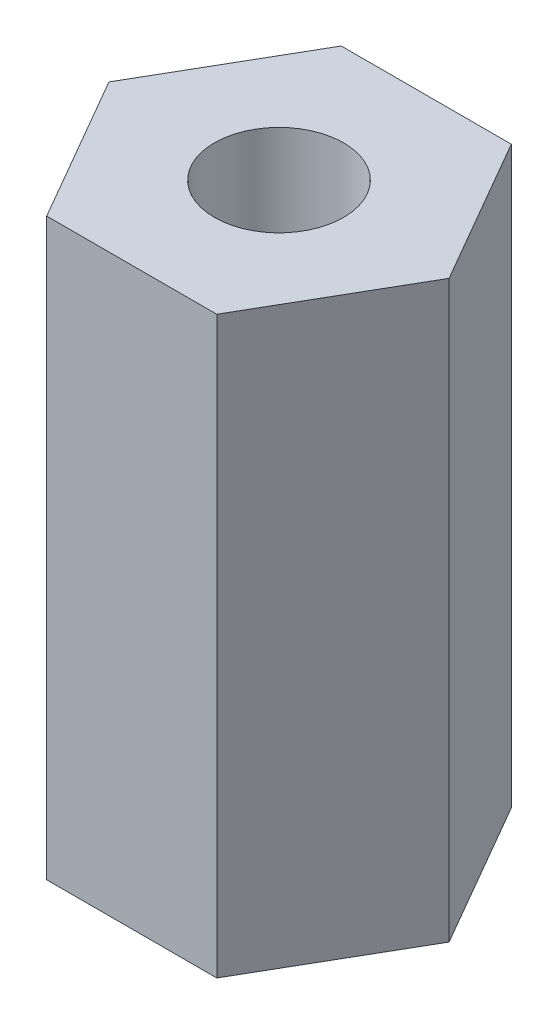
ISO-10303-21;
HEADER;
FILE_DESCRIPTION(('STEP AP214'),'2;1');
FILE_NAME('part.step','',(''),(''),'','','');
FILE_SCHEMA(('AUTOMOTIVE_DESIGN { 1 0 10303 214 1 1 1 1 }'));
ENDSEC;
DATA;
#1=APPLICATION_CONTEXT('core data for automotive mechanical design processes');
#2=APPLICATION_PROTOCOL_DEFINITION('international standard','automotive_design',2000,#1);
#3=PRODUCT_CONTEXT('',#1,'mechanical');
#4=PRODUCT('Part','Part','',(#3));
#5=PRODUCT_RELATED_PRODUCT_CATEGORY('part','',(#4));
#6=PRODUCT_DEFINITION_FORMATION('','',#4);
#7=PRODUCT_DEFINITION_CONTEXT('part definition',#1,'design');
#8=PRODUCT_DEFINITION('design','',#6,#7);
#9=PRODUCT_DEFINITION_SHAPE('','',#8);
#10=(LENGTH_UNIT() NAMED_UNIT(*) SI_UNIT(.MILLI.,.METRE.));
#11=(NAMED_UNIT(*) PLANE_ANGLE_UNIT() SI_UNIT($,.RADIAN.));
#12=(NAMED_UNIT(*) SI_UNIT($,.STERADIAN.) SOLID_ANGLE_UNIT());
#13=UNCERTAINTY_MEASURE_WITH_UNIT(LENGTH_MEASURE(1.E-05),#10,'distance_accuracy_value','');
#14=(GEOMETRIC_REPRESENTATION_CONTEXT(3) GLOBAL_UNCERTAINTY_ASSIGNED_CONTEXT((#13)) GLOBAL_UNIT_ASSIGNED_CONTEXT((#10,
#11,#12)) REPRESENTATION_CONTEXT('',''));
#15=CARTESIAN_POINT('',(0.,0.,0.));
#16=DIRECTION('',(0.,0.,1.));
#17=DIRECTION('',(1.,0.,0.));
#18=AXIS2_PLACEMENT_3D('',#15,#16,#17);
#19=CARTESIAN_POINT('',(2.5,16.9,4.3301270189222));
#20=DIRECTION('',(-0.866025403784439,0.,-0.5));
#21=DIRECTION('',(-0.5,0.,0.866025403784439));
#22=AXIS2_PLACEMENT_3D('',#19,#20,#21);
#23=PLANE('',#22);
#24=DIRECTION('',(0.5,0.,-0.866025403784439));
#25=VECTOR('',#24,1.);
#26=CARTESIAN_POINT('',(2.5,0.,4.3301270189222));
#27=LINE('',#26,#25);
#28=CARTESIAN_POINT('',(2.5,0.,4.3301270189222));
#29=VERTEX_POINT('',#28);
#30=CARTESIAN_POINT('',(5.,0.,0.));
#31=VERTEX_POINT('',#30);
#32=EDGE_CURVE('E122',#29,#31,#27,.T.);
#33=ORIENTED_EDGE('',*,*,#32,.T.);
#34=DIRECTION('',(0.,-1.,0.));
#35=VECTOR('',#34,1.);
#36=CARTESIAN_POINT('',(5.,16.9,0.));
#37=LINE('',#36,#35);
#38=CARTESIAN_POINT('',(5.,16.9,0.));
#39=VERTEX_POINT('',#38);
#40=EDGE_CURVE('E11',#39,#31,#37,.T.);
#41=ORIENTED_EDGE('',*,*,#40,.F.);
#42=DIRECTION('',(0.5,0.,-0.866025403784439));
#43=VECTOR('',#42,1.);
#44=CARTESIAN_POINT('',(2.5,16.9,4.3301270189222));
#45=LINE('',#44,#43);
#46=CARTESIAN_POINT('',(2.5,16.9,4.3301270189222));
#47=VERTEX_POINT('',#46);
#48=EDGE_CURVE('E133',#47,#39,#45,.T.);
#49=ORIENTED_EDGE('',*,*,#48,.F.);
#50=DIRECTION('',(0.,-1.,0.));
#51=VECTOR('',#50,1.);
#52=CARTESIAN_POINT('',(2.5,16.9,4.3301270189222));
#53=LINE('',#52,#51);
#54=EDGE_CURVE('E118',#47,#29,#53,.T.);
#55=ORIENTED_EDGE('',*,*,#54,.T.);
#56=EDGE_LOOP('',(#33,#41,#49,#55));
#57=FACE_BOUND('',#56,.T.);
#58=ADVANCED_FACE('F38',(#57),#23,.F.);
#59=CARTESIAN_POINT('',(5.,16.9,0.));
#60=DIRECTION('',(-0.866025403784439,0.,0.5));
#61=DIRECTION('',(0.5,0.,0.866025403784439));
#62=AXIS2_PLACEMENT_3D('',#59,#60,#61);
#63=PLANE('',#62);
#64=DIRECTION('',(-0.5,0.,-0.866025403784439));
#65=VECTOR('',#64,1.);
#66=CARTESIAN_POINT('',(5.,0.,0.));
#67=LINE('',#66,#65);
#68=CARTESIAN_POINT('',(2.5,0.,-4.3301270189222));
#69=VERTEX_POINT('',#68);
#70=EDGE_CURVE('E125',#31,#69,#67,.T.);
#71=ORIENTED_EDGE('',*,*,#70,.T.);
#72=DIRECTION('',(0.,-1.,0.));
#73=VECTOR('',#72,1.);
#74=CARTESIAN_POINT('',(2.5,16.9,-4.3301270189222));
#75=LINE('',#74,#73);
#76=CARTESIAN_POINT('',(2.5,16.9,-4.3301270189222));
#77=VERTEX_POINT('',#76);
#78=EDGE_CURVE('E46',#77,#69,#75,.T.);
#79=ORIENTED_EDGE('',*,*,#78,.F.);
#80=DIRECTION('',(-0.5,0.,-0.866025403784439));
#81=VECTOR('',#80,1.);
#82=CARTESIAN_POINT('',(5.,16.9,0.));
#83=LINE('',#82,#81);
#84=EDGE_CURVE('E91',#39,#77,#83,.T.);
#85=ORIENTED_EDGE('',*,*,#84,.F.);
#86=ORIENTED_EDGE('',*,*,#40,.T.);
#87=EDGE_LOOP('',(#71,#79,#85,#86));
#88=FACE_BOUND('',#87,.T.);
#89=ADVANCED_FACE('F158',(#88),#63,.F.);
#90=CARTESIAN_POINT('',(2.5,16.9,-4.3301270189222));
#91=DIRECTION('',(0.,0.,1.));
#92=DIRECTION('',(1.,0.,0.));
#93=AXIS2_PLACEMENT_3D('',#90,#91,#92);
#94=PLANE('',#93);
#95=DIRECTION('',(-1.,0.,0.));
#96=VECTOR('',#95,1.);
#97=CARTESIAN_POINT('',(2.5,0.,-4.3301270189222));
#98=LINE('',#97,#96);
#99=CARTESIAN_POINT('',(-2.5,0.,-4.3301270189222));
#100=VERTEX_POINT('',#99);
#101=EDGE_CURVE('E128',#69,#100,#98,.T.);
#102=ORIENTED_EDGE('',*,*,#101,.T.);
#103=DIRECTION('',(0.,-1.,0.));
#104=VECTOR('',#103,1.);
#105=CARTESIAN_POINT('',(-2.5,16.9,-4.3301270189222));
#106=LINE('',#105,#104);
#107=CARTESIAN_POINT('',(-2.5,16.9,-4.3301270189222));
#108=VERTEX_POINT('',#107);
#109=EDGE_CURVE('E113',#108,#100,#106,.T.);
#110=ORIENTED_EDGE('',*,*,#109,.F.);
#111=DIRECTION('',(-1.,0.,0.));
#112=VECTOR('',#111,1.);
#113=CARTESIAN_POINT('',(2.5,16.9,-4.3301270189222));
#114=LINE('',#113,#112);
#115=EDGE_CURVE('E104',#77,#108,#114,.T.);
#116=ORIENTED_EDGE('',*,*,#115,.F.);
#117=ORIENTED_EDGE('',*,*,#78,.T.);
#118=EDGE_LOOP('',(#102,#110,#116,#117));
#119=FACE_BOUND('',#118,.T.);
#120=ADVANCED_FACE('F139',(#119),#94,.F.);
#121=CARTESIAN_POINT('',(-2.5,16.9,-4.3301270189222));
#122=DIRECTION('',(0.866025403784439,0.,0.5));
#123=DIRECTION('',(0.5,0.,-0.866025403784439));
#124=AXIS2_PLACEMENT_3D('',#121,#122,#123);
#125=PLANE('',#124);
#126=DIRECTION('',(-0.5,0.,0.866025403784439));
#127=VECTOR('',#126,1.);
#128=CARTESIAN_POINT('',(-2.5,0.,-4.3301270189222));
#129=LINE('',#128,#127);
#130=CARTESIAN_POINT('',(-5.,0.,0.));
#131=VERTEX_POINT('',#130);
#132=EDGE_CURVE('E112',#100,#131,#129,.T.);
#133=ORIENTED_EDGE('',*,*,#132,.T.);
#134=DIRECTION('',(0.,-1.,0.));
#135=VECTOR('',#134,1.);
#136=CARTESIAN_POINT('',(-5.,16.9,0.));
#137=LINE('',#136,#135);
#138=CARTESIAN_POINT('',(-5.,16.9,0.));
#139=VERTEX_POINT('',#138);
#140=EDGE_CURVE('E109',#139,#131,#137,.T.);
#141=ORIENTED_EDGE('',*,*,#140,.F.);
#142=DIRECTION('',(-0.5,0.,0.866025403784439));
#143=VECTOR('',#142,1.);
#144=CARTESIAN_POINT('',(-2.5,16.9,-4.3301270189222));
#145=LINE('',#144,#143);
#146=EDGE_CURVE('E98',#108,#139,#145,.T.);
#147=ORIENTED_EDGE('',*,*,#146,.F.);
#148=ORIENTED_EDGE('',*,*,#109,.T.);
#149=EDGE_LOOP('',(#133,#141,#147,#148));
#150=FACE_BOUND('',#149,.T.);
#151=ADVANCED_FACE('F110',(#150),#125,.F.);
#152=CARTESIAN_POINT('',(-5.,16.9,0.));
#153=DIRECTION('',(0.866025403784439,0.,-0.5));
#154=DIRECTION('',(-0.5,0.,-0.866025403784439));
#155=AXIS2_PLACEMENT_3D('',#152,#153,#154);
#156=PLANE('',#155);
#157=DIRECTION('',(0.5,0.,0.866025403784439));
#158=VECTOR('',#157,1.);
#159=CARTESIAN_POINT('',(-5.,0.,0.));
#160=LINE('',#159,#158);
#161=CARTESIAN_POINT('',(-2.5,0.,4.3301270189222));
#162=VERTEX_POINT('',#161);
#163=EDGE_CURVE('E77',#131,#162,#160,.T.);
#164=ORIENTED_EDGE('',*,*,#163,.T.);
#165=DIRECTION('',(0.,-1.,0.));
#166=VECTOR('',#165,1.);
#167=CARTESIAN_POINT('',(-2.5,16.9,4.3301270189222));
#168=LINE('',#167,#166);
#169=CARTESIAN_POINT('',(-2.5,16.9,4.3301270189222));
#170=VERTEX_POINT('',#169);
#171=EDGE_CURVE('E114',#170,#162,#168,.T.);
#172=ORIENTED_EDGE('',*,*,#171,.F.);
#173=DIRECTION('',(0.5,0.,0.866025403784439));
#174=VECTOR('',#173,1.);
#175=CARTESIAN_POINT('',(-5.,16.9,0.));
#176=LINE('',#175,#174);
#177=EDGE_CURVE('E102',#139,#170,#176,.T.);
#178=ORIENTED_EDGE('',*,*,#177,.F.);
#179=ORIENTED_EDGE('',*,*,#140,.T.);
#180=EDGE_LOOP('',(#164,#172,#178,#179));
#181=FACE_BOUND('',#180,.T.);
#182=ADVANCED_FACE('F116',(#181),#156,.F.);
#183=CARTESIAN_POINT('',(-2.5,16.9,4.3301270189222));
#184=DIRECTION('',(0.,0.,-1.));
#185=DIRECTION('',(-1.,0.,0.));
#186=AXIS2_PLACEMENT_3D('',#183,#184,#185);
#187=PLANE('',#186);
#188=DIRECTION('',(1.,0.,0.));
#189=VECTOR('',#188,1.);
#190=CARTESIAN_POINT('',(-2.5,0.,4.3301270189222));
#191=LINE('',#190,#189);
#192=EDGE_CURVE('E83',#162,#29,#191,.T.);
#193=ORIENTED_EDGE('',*,*,#192,.T.);
#194=ORIENTED_EDGE('',*,*,#54,.F.);
#195=DIRECTION('',(1.,0.,0.));
#196=VECTOR('',#195,1.);
#197=CARTESIAN_POINT('',(-2.5,16.9,4.3301270189222));
#198=LINE('',#197,#196);
#199=EDGE_CURVE('E54',#170,#47,#198,.T.);
#200=ORIENTED_EDGE('',*,*,#199,.F.);
#201=ORIENTED_EDGE('',*,*,#171,.T.);
#202=EDGE_LOOP('',(#193,#194,#200,#201));
#203=FACE_BOUND('',#202,.T.);
#204=ADVANCED_FACE('F146',(#203),#187,.F.);
#205=CARTESIAN_POINT('',(0.,16.9,0.));
#206=DIRECTION('',(0.,1.,0.));
#207=DIRECTION('',(0.,0.,1.));
#208=AXIS2_PLACEMENT_3D('',#205,#206,#207);
#209=PLANE('',#208);
#210=CARTESIAN_POINT('',(0.,16.9,0.));
#211=DIRECTION('',(0.,1.,0.));
#212=DIRECTION('',(0.,0.,1.));
#213=AXIS2_PLACEMENT_3D('',#210,#211,#212);
#214=CIRCLE('',#213,1.9);
#215=CARTESIAN_POINT('',(0.,16.9,1.9));
#216=VERTEX_POINT('',#215);
#217=EDGE_CURVE('E213',#216,#216,#214,.T.);
#218=ORIENTED_EDGE('',*,*,#217,.F.);
#219=EDGE_LOOP('',(#218));
#220=FACE_BOUND('',#219,.T.);
#221=ORIENTED_EDGE('',*,*,#48,.T.);
#222=ORIENTED_EDGE('',*,*,#84,.T.);
#223=ORIENTED_EDGE('',*,*,#115,.T.);
#224=ORIENTED_EDGE('',*,*,#146,.T.);
#225=ORIENTED_EDGE('',*,*,#177,.T.);
#226=ORIENTED_EDGE('',*,*,#199,.T.);
#227=EDGE_LOOP('',(#221,#222,#223,#224,#225,#226));
#228=FACE_BOUND('',#227,.T.);
#229=ADVANCED_FACE('F100',(#220,#228),#209,.T.);
#230=CARTESIAN_POINT('',(0.,0.,0.));
#231=DIRECTION('',(0.,1.,0.));
#232=DIRECTION('',(0.,0.,1.));
#233=AXIS2_PLACEMENT_3D('',#230,#231,#232);
#234=PLANE('',#233);
#235=CARTESIAN_POINT('',(0.,0.,0.));
#236=DIRECTION('',(0.,1.,0.));
#237=DIRECTION('',(0.,0.,1.));
#238=AXIS2_PLACEMENT_3D('',#235,#236,#237);
#239=CIRCLE('',#238,1.9);
#240=CARTESIAN_POINT('',(0.,0.,1.9));
#241=VERTEX_POINT('',#240);
#242=EDGE_CURVE('E126',#241,#241,#239,.T.);
#243=ORIENTED_EDGE('',*,*,#242,.T.);
#244=EDGE_LOOP('',(#243));
#245=FACE_BOUND('',#244,.T.);
#246=ORIENTED_EDGE('',*,*,#32,.F.);
#247=ORIENTED_EDGE('',*,*,#192,.F.);
#248=ORIENTED_EDGE('',*,*,#163,.F.);
#249=ORIENTED_EDGE('',*,*,#132,.F.);
#250=ORIENTED_EDGE('',*,*,#101,.F.);
#251=ORIENTED_EDGE('',*,*,#70,.F.);
#252=EDGE_LOOP('',(#246,#247,#248,#249,#250,#251));
#253=FACE_BOUND('',#252,.T.);
#254=ADVANCED_FACE('F142',(#245,#253),#234,.F.);
#255=CARTESIAN_POINT('',(0.,0.,0.));
#256=DIRECTION('',(0.,1.,0.));
#257=DIRECTION('',(0.,0.,1.));
#258=AXIS2_PLACEMENT_3D('',#255,#256,#257);
#259=CYLINDRICAL_SURFACE('',#258,1.9);
#260=ORIENTED_EDGE('',*,*,#242,.F.);
#261=EDGE_LOOP('',(#260));
#262=FACE_BOUND('',#261,.T.);
#263=ORIENTED_EDGE('',*,*,#217,.T.);
#264=EDGE_LOOP('',(#263));
#265=FACE_BOUND('',#264,.T.);
#266=ADVANCED_FACE('F195',(#262,#265),#259,.F.);
#267=CLOSED_SHELL('',(#58,#89,#120,#151,#182,#204,#229,#254,#266));
#268=MANIFOLD_SOLID_BREP('B2',#267);
#269=ADVANCED_BREP_SHAPE_REPRESENTATION('',(#18,#268),#14);
#270=SHAPE_DEFINITION_REPRESENTATION(#9,#269);
ENDSEC;
END-ISO-10303-21;
